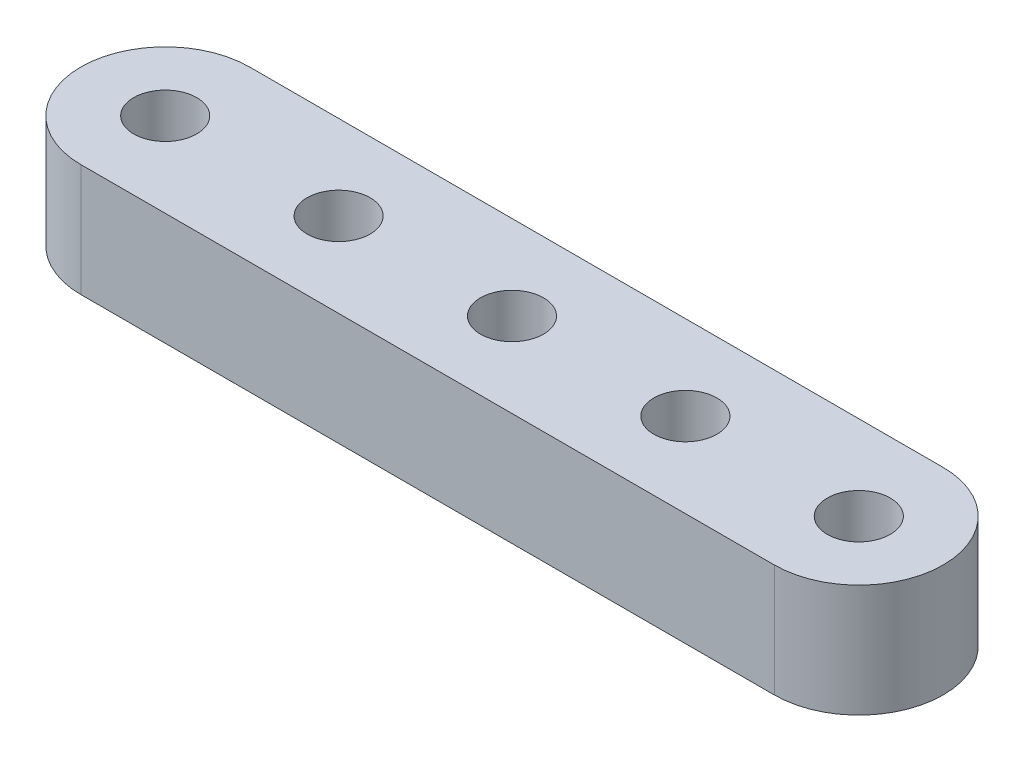
ISO-10303-21;
HEADER;
FILE_DESCRIPTION(('STEP AP214'),'2;1');
FILE_NAME('part.step','',(''),(''),'','','');
FILE_SCHEMA(('AUTOMOTIVE_DESIGN { 1 0 10303 214 1 1 1 1 }'));
ENDSEC;
DATA;
#1=APPLICATION_CONTEXT('core data for automotive mechanical design processes');
#2=APPLICATION_PROTOCOL_DEFINITION('international standard','automotive_design',2000,#1);
#3=PRODUCT_CONTEXT('',#1,'mechanical');
#4=PRODUCT('Part','Part','',(#3));
#5=PRODUCT_RELATED_PRODUCT_CATEGORY('part','',(#4));
#6=PRODUCT_DEFINITION_FORMATION('','',#4);
#7=PRODUCT_DEFINITION_CONTEXT('part definition',#1,'design');
#8=PRODUCT_DEFINITION('design','',#6,#7);
#9=PRODUCT_DEFINITION_SHAPE('','',#8);
#10=(LENGTH_UNIT() NAMED_UNIT(*) SI_UNIT(.MILLI.,.METRE.));
#11=(NAMED_UNIT(*) PLANE_ANGLE_UNIT() SI_UNIT($,.RADIAN.));
#12=(NAMED_UNIT(*) SI_UNIT($,.STERADIAN.) SOLID_ANGLE_UNIT());
#13=UNCERTAINTY_MEASURE_WITH_UNIT(LENGTH_MEASURE(1.E-05),#10,'distance_accuracy_value','');
#14=(GEOMETRIC_REPRESENTATION_CONTEXT(3) GLOBAL_UNCERTAINTY_ASSIGNED_CONTEXT((#13)) GLOBAL_UNIT_ASSIGNED_CONTEXT((#10,
#11,#12)) REPRESENTATION_CONTEXT('',''));
#15=CARTESIAN_POINT('',(0.,0.,0.));
#16=DIRECTION('',(0.,0.,1.));
#17=DIRECTION('',(1.,0.,0.));
#18=AXIS2_PLACEMENT_3D('',#15,#16,#17);
#19=CARTESIAN_POINT('',(19.558,0.,0.));
#20=DIRECTION('',(0.,1.,0.));
#21=DIRECTION('',(0.,0.,1.));
#22=AXIS2_PLACEMENT_3D('',#19,#20,#21);
#23=CYLINDRICAL_SURFACE('',#22,4.7625);
#24=CARTESIAN_POINT('',(19.558,6.35,0.));
#25=DIRECTION('',(0.,1.,0.));
#26=DIRECTION('',(0.,0.,1.));
#27=AXIS2_PLACEMENT_3D('',#24,#25,#26);
#28=CIRCLE('',#27,4.7625);
#29=CARTESIAN_POINT('',(19.558,6.35,4.76250000000001));
#30=VERTEX_POINT('',#29);
#31=CARTESIAN_POINT('',(19.558,6.35,-4.7625));
#32=VERTEX_POINT('',#31);
#33=EDGE_CURVE('E97',#30,#32,#28,.T.);
#34=ORIENTED_EDGE('',*,*,#33,.F.);
#35=DIRECTION('',(0.,1.,0.));
#36=VECTOR('',#35,1.);
#37=CARTESIAN_POINT('',(19.558,0.,4.76250000000001));
#38=LINE('',#37,#36);
#39=CARTESIAN_POINT('',(19.558,0.,4.76250000000001));
#40=VERTEX_POINT('',#39);
#41=EDGE_CURVE('E11',#40,#30,#38,.T.);
#42=ORIENTED_EDGE('',*,*,#41,.F.);
#43=CARTESIAN_POINT('',(19.558,0.,0.));
#44=DIRECTION('',(0.,1.,0.));
#45=DIRECTION('',(0.,0.,1.));
#46=AXIS2_PLACEMENT_3D('',#43,#44,#45);
#47=CIRCLE('',#46,4.7625);
#48=CARTESIAN_POINT('',(19.558,0.,-4.7625));
#49=VERTEX_POINT('',#48);
#50=EDGE_CURVE('E90',#40,#49,#47,.T.);
#51=ORIENTED_EDGE('',*,*,#50,.T.);
#52=DIRECTION('',(0.,1.,0.));
#53=VECTOR('',#52,1.);
#54=CARTESIAN_POINT('',(19.558,0.,-4.7625));
#55=LINE('',#54,#53);
#56=EDGE_CURVE('E35',#49,#32,#55,.T.);
#57=ORIENTED_EDGE('',*,*,#56,.T.);
#58=EDGE_LOOP('',(#34,#42,#51,#57));
#59=FACE_BOUND('',#58,.T.);
#60=ADVANCED_FACE('F32',(#59),#23,.T.);
#61=CARTESIAN_POINT('',(-19.558,0.,4.76250000000001));
#62=DIRECTION('',(0.,0.,1.));
#63=DIRECTION('',(1.,0.,0.));
#64=AXIS2_PLACEMENT_3D('',#61,#62,#63);
#65=PLANE('',#64);
#66=DIRECTION('',(1.,0.,0.));
#67=VECTOR('',#66,1.);
#68=CARTESIAN_POINT('',(-19.558,6.35,4.76250000000001));
#69=LINE('',#68,#67);
#70=CARTESIAN_POINT('',(-19.558,6.35,4.76250000000001));
#71=VERTEX_POINT('',#70);
#72=EDGE_CURVE('E92',#71,#30,#69,.T.);
#73=ORIENTED_EDGE('',*,*,#72,.F.);
#74=DIRECTION('',(0.,1.,0.));
#75=VECTOR('',#74,1.);
#76=CARTESIAN_POINT('',(-19.558,0.,4.76250000000001));
#77=LINE('',#76,#75);
#78=CARTESIAN_POINT('',(-19.558,0.,4.76250000000001));
#79=VERTEX_POINT('',#78);
#80=EDGE_CURVE('E41',#79,#71,#77,.T.);
#81=ORIENTED_EDGE('',*,*,#80,.F.);
#82=DIRECTION('',(1.,0.,0.));
#83=VECTOR('',#82,1.);
#84=CARTESIAN_POINT('',(-19.558,0.,4.76250000000001));
#85=LINE('',#84,#83);
#86=EDGE_CURVE('E87',#79,#40,#85,.T.);
#87=ORIENTED_EDGE('',*,*,#86,.T.);
#88=ORIENTED_EDGE('',*,*,#41,.T.);
#89=EDGE_LOOP('',(#73,#81,#87,#88));
#90=FACE_BOUND('',#89,.T.);
#91=ADVANCED_FACE('F108',(#90),#65,.T.);
#92=CARTESIAN_POINT('',(-19.558,0.,0.));
#93=DIRECTION('',(0.,1.,0.));
#94=DIRECTION('',(0.,0.,1.));
#95=AXIS2_PLACEMENT_3D('',#92,#93,#94);
#96=CYLINDRICAL_SURFACE('',#95,4.7625);
#97=CARTESIAN_POINT('',(-19.558,6.35,0.));
#98=DIRECTION('',(0.,1.,0.));
#99=DIRECTION('',(0.,0.,1.));
#100=AXIS2_PLACEMENT_3D('',#97,#98,#99);
#101=CIRCLE('',#100,4.7625);
#102=CARTESIAN_POINT('',(-19.558,6.35,-4.7625));
#103=VERTEX_POINT('',#102);
#104=EDGE_CURVE('E82',#103,#71,#101,.T.);
#105=ORIENTED_EDGE('',*,*,#104,.F.);
#106=DIRECTION('',(0.,1.,0.));
#107=VECTOR('',#106,1.);
#108=CARTESIAN_POINT('',(-19.558,0.,-4.7625));
#109=LINE('',#108,#107);
#110=CARTESIAN_POINT('',(-19.558,0.,-4.7625));
#111=VERTEX_POINT('',#110);
#112=EDGE_CURVE('E77',#111,#103,#109,.T.);
#113=ORIENTED_EDGE('',*,*,#112,.F.);
#114=CARTESIAN_POINT('',(-19.558,0.,0.));
#115=DIRECTION('',(0.,1.,0.));
#116=DIRECTION('',(0.,0.,1.));
#117=AXIS2_PLACEMENT_3D('',#114,#115,#116);
#118=CIRCLE('',#117,4.7625);
#119=EDGE_CURVE('E80',#111,#79,#118,.T.);
#120=ORIENTED_EDGE('',*,*,#119,.T.);
#121=ORIENTED_EDGE('',*,*,#80,.T.);
#122=EDGE_LOOP('',(#105,#113,#120,#121));
#123=FACE_BOUND('',#122,.T.);
#124=ADVANCED_FACE('F79',(#123),#96,.T.);
#125=CARTESIAN_POINT('',(19.558,0.,-4.7625));
#126=DIRECTION('',(0.,0.,-1.));
#127=DIRECTION('',(-1.,0.,0.));
#128=AXIS2_PLACEMENT_3D('',#125,#126,#127);
#129=PLANE('',#128);
#130=DIRECTION('',(-1.,0.,0.));
#131=VECTOR('',#130,1.);
#132=CARTESIAN_POINT('',(19.558,6.35,-4.7625));
#133=LINE('',#132,#131);
#134=EDGE_CURVE('E100',#32,#103,#133,.T.);
#135=ORIENTED_EDGE('',*,*,#134,.F.);
#136=ORIENTED_EDGE('',*,*,#56,.F.);
#137=DIRECTION('',(-1.,0.,0.));
#138=VECTOR('',#137,1.);
#139=CARTESIAN_POINT('',(19.558,0.,-4.7625));
#140=LINE('',#139,#138);
#141=EDGE_CURVE('E86',#49,#111,#140,.T.);
#142=ORIENTED_EDGE('',*,*,#141,.T.);
#143=ORIENTED_EDGE('',*,*,#112,.T.);
#144=EDGE_LOOP('',(#135,#136,#142,#143));
#145=FACE_BOUND('',#144,.T.);
#146=ADVANCED_FACE('F89',(#145),#129,.T.);
#147=CARTESIAN_POINT('',(19.558,0.,0.));
#148=DIRECTION('',(0.,1.,0.));
#149=DIRECTION('',(0.,0.,1.));
#150=AXIS2_PLACEMENT_3D('',#147,#148,#149);
#151=PLANE('',#150);
#152=CARTESIAN_POINT('',(-19.558,0.,0.));
#153=DIRECTION('',(0.,1.,0.));
#154=DIRECTION('',(0.,0.,-1.));
#155=AXIS2_PLACEMENT_3D('',#152,#153,#154);
#156=CIRCLE('',#155,1.77799999999998);
#157=CARTESIAN_POINT('',(-19.558,0.,-1.77799999999998));
#158=VERTEX_POINT('',#157);
#159=EDGE_CURVE('E153',#158,#158,#156,.T.);
#160=ORIENTED_EDGE('',*,*,#159,.T.);
#161=EDGE_LOOP('',(#160));
#162=FACE_BOUND('',#161,.T.);
#163=CARTESIAN_POINT('',(-9.779,0.,0.));
#164=DIRECTION('',(0.,1.,0.));
#165=DIRECTION('',(0.,0.,-1.));
#166=AXIS2_PLACEMENT_3D('',#163,#164,#165);
#167=CIRCLE('',#166,1.77799999999999);
#168=CARTESIAN_POINT('',(-9.779,0.,-1.77799999999999));
#169=VERTEX_POINT('',#168);
#170=EDGE_CURVE('E161',#169,#169,#167,.T.);
#171=ORIENTED_EDGE('',*,*,#170,.T.);
#172=EDGE_LOOP('',(#171));
#173=FACE_BOUND('',#172,.T.);
#174=CARTESIAN_POINT('',(0.,0.,0.));
#175=DIRECTION('',(0.,1.,0.));
#176=DIRECTION('',(0.,0.,-1.));
#177=AXIS2_PLACEMENT_3D('',#174,#175,#176);
#178=CIRCLE('',#177,1.77799999999999);
#179=CARTESIAN_POINT('',(0.,0.,-1.77799999999999));
#180=VERTEX_POINT('',#179);
#181=EDGE_CURVE('E167',#180,#180,#178,.T.);
#182=ORIENTED_EDGE('',*,*,#181,.T.);
#183=EDGE_LOOP('',(#182));
#184=FACE_BOUND('',#183,.T.);
#185=CARTESIAN_POINT('',(9.779,0.,0.));
#186=DIRECTION('',(0.,1.,0.));
#187=DIRECTION('',(0.,0.,-1.));
#188=AXIS2_PLACEMENT_3D('',#185,#186,#187);
#189=CIRCLE('',#188,1.77799999999999);
#190=CARTESIAN_POINT('',(9.779,0.,-1.77799999999998));
#191=VERTEX_POINT('',#190);
#192=EDGE_CURVE('E173',#191,#191,#189,.T.);
#193=ORIENTED_EDGE('',*,*,#192,.T.);
#194=EDGE_LOOP('',(#193));
#195=FACE_BOUND('',#194,.T.);
#196=CARTESIAN_POINT('',(19.558,0.,0.));
#197=DIRECTION('',(0.,1.,0.));
#198=DIRECTION('',(0.,0.,-1.));
#199=AXIS2_PLACEMENT_3D('',#196,#197,#198);
#200=CIRCLE('',#199,1.77799999999999);
#201=CARTESIAN_POINT('',(19.558,0.,-1.77799999999998));
#202=VERTEX_POINT('',#201);
#203=EDGE_CURVE('E101',#202,#202,#200,.T.);
#204=ORIENTED_EDGE('',*,*,#203,.T.);
#205=EDGE_LOOP('',(#204));
#206=FACE_BOUND('',#205,.T.);
#207=ORIENTED_EDGE('',*,*,#50,.F.);
#208=ORIENTED_EDGE('',*,*,#86,.F.);
#209=ORIENTED_EDGE('',*,*,#119,.F.);
#210=ORIENTED_EDGE('',*,*,#141,.F.);
#211=EDGE_LOOP('',(#207,#208,#209,#210));
#212=FACE_BOUND('',#211,.T.);
#213=ADVANCED_FACE('F85',(#162,#173,#184,#195,#206,#212),#151,.F.);
#214=CARTESIAN_POINT('',(19.558,6.35,0.));
#215=DIRECTION('',(0.,1.,0.));
#216=DIRECTION('',(0.,0.,1.));
#217=AXIS2_PLACEMENT_3D('',#214,#215,#216);
#218=PLANE('',#217);
#219=CARTESIAN_POINT('',(-19.558,6.35,0.));
#220=DIRECTION('',(0.,1.,0.));
#221=DIRECTION('',(0.,0.,-1.));
#222=AXIS2_PLACEMENT_3D('',#219,#220,#221);
#223=CIRCLE('',#222,1.77799999999998);
#224=CARTESIAN_POINT('',(-19.558,6.35,-1.77799999999998));
#225=VERTEX_POINT('',#224);
#226=EDGE_CURVE('E156',#225,#225,#223,.T.);
#227=ORIENTED_EDGE('',*,*,#226,.F.);
#228=EDGE_LOOP('',(#227));
#229=FACE_BOUND('',#228,.T.);
#230=CARTESIAN_POINT('',(-9.779,6.35,0.));
#231=DIRECTION('',(0.,1.,0.));
#232=DIRECTION('',(0.,0.,-1.));
#233=AXIS2_PLACEMENT_3D('',#230,#231,#232);
#234=CIRCLE('',#233,1.77799999999999);
#235=CARTESIAN_POINT('',(-9.779,6.35,-1.77799999999999));
#236=VERTEX_POINT('',#235);
#237=EDGE_CURVE('E158',#236,#236,#234,.T.);
#238=ORIENTED_EDGE('',*,*,#237,.F.);
#239=EDGE_LOOP('',(#238));
#240=FACE_BOUND('',#239,.T.);
#241=CARTESIAN_POINT('',(0.,6.35,0.));
#242=DIRECTION('',(0.,1.,0.));
#243=DIRECTION('',(0.,0.,-1.));
#244=AXIS2_PLACEMENT_3D('',#241,#242,#243);
#245=CIRCLE('',#244,1.77799999999999);
#246=CARTESIAN_POINT('',(0.,6.35,-1.77799999999999));
#247=VERTEX_POINT('',#246);
#248=EDGE_CURVE('E164',#247,#247,#245,.T.);
#249=ORIENTED_EDGE('',*,*,#248,.F.);
#250=EDGE_LOOP('',(#249));
#251=FACE_BOUND('',#250,.T.);
#252=CARTESIAN_POINT('',(9.779,6.35,0.));
#253=DIRECTION('',(0.,1.,0.));
#254=DIRECTION('',(0.,0.,-1.));
#255=AXIS2_PLACEMENT_3D('',#252,#253,#254);
#256=CIRCLE('',#255,1.77799999999999);
#257=CARTESIAN_POINT('',(9.779,6.35,-1.77799999999998));
#258=VERTEX_POINT('',#257);
#259=EDGE_CURVE('E170',#258,#258,#256,.T.);
#260=ORIENTED_EDGE('',*,*,#259,.F.);
#261=EDGE_LOOP('',(#260));
#262=FACE_BOUND('',#261,.T.);
#263=CARTESIAN_POINT('',(19.558,6.35,0.));
#264=DIRECTION('',(0.,1.,0.));
#265=DIRECTION('',(0.,0.,-1.));
#266=AXIS2_PLACEMENT_3D('',#263,#264,#265);
#267=CIRCLE('',#266,1.77799999999999);
#268=CARTESIAN_POINT('',(19.558,6.35,-1.77799999999998));
#269=VERTEX_POINT('',#268);
#270=EDGE_CURVE('E176',#269,#269,#267,.T.);
#271=ORIENTED_EDGE('',*,*,#270,.F.);
#272=EDGE_LOOP('',(#271));
#273=FACE_BOUND('',#272,.T.);
#274=ORIENTED_EDGE('',*,*,#33,.T.);
#275=ORIENTED_EDGE('',*,*,#134,.T.);
#276=ORIENTED_EDGE('',*,*,#104,.T.);
#277=ORIENTED_EDGE('',*,*,#72,.T.);
#278=EDGE_LOOP('',(#274,#275,#276,#277));
#279=FACE_BOUND('',#278,.T.);
#280=ADVANCED_FACE('F107',(#229,#240,#251,#262,#273,#279),#218,.T.);
#281=CARTESIAN_POINT('',(19.558,0.,0.));
#282=DIRECTION('',(0.,1.,0.));
#283=DIRECTION('',(0.,0.,1.));
#284=AXIS2_PLACEMENT_3D('',#281,#282,#283);
#285=CYLINDRICAL_SURFACE('',#284,1.77799999999999);
#286=ORIENTED_EDGE('',*,*,#203,.F.);
#287=EDGE_LOOP('',(#286));
#288=FACE_BOUND('',#287,.T.);
#289=ORIENTED_EDGE('',*,*,#270,.T.);
#290=EDGE_LOOP('',(#289));
#291=FACE_BOUND('',#290,.T.);
#292=ADVANCED_FACE('F126',(#288,#291),#285,.F.);
#293=CARTESIAN_POINT('',(9.779,0.,0.));
#294=DIRECTION('',(0.,1.,0.));
#295=DIRECTION('',(0.,0.,1.));
#296=AXIS2_PLACEMENT_3D('',#293,#294,#295);
#297=CYLINDRICAL_SURFACE('',#296,1.77799999999999);
#298=ORIENTED_EDGE('',*,*,#192,.F.);
#299=EDGE_LOOP('',(#298));
#300=FACE_BOUND('',#299,.T.);
#301=ORIENTED_EDGE('',*,*,#259,.T.);
#302=EDGE_LOOP('',(#301));
#303=FACE_BOUND('',#302,.T.);
#304=ADVANCED_FACE('F133',(#300,#303),#297,.F.);
#305=CARTESIAN_POINT('',(0.,0.,0.));
#306=DIRECTION('',(0.,1.,0.));
#307=DIRECTION('',(0.,0.,1.));
#308=AXIS2_PLACEMENT_3D('',#305,#306,#307);
#309=CYLINDRICAL_SURFACE('',#308,1.77799999999999);
#310=ORIENTED_EDGE('',*,*,#181,.F.);
#311=EDGE_LOOP('',(#310));
#312=FACE_BOUND('',#311,.T.);
#313=ORIENTED_EDGE('',*,*,#248,.T.);
#314=EDGE_LOOP('',(#313));
#315=FACE_BOUND('',#314,.T.);
#316=ADVANCED_FACE('F137',(#312,#315),#309,.F.);
#317=CARTESIAN_POINT('',(-9.779,0.,0.));
#318=DIRECTION('',(0.,1.,0.));
#319=DIRECTION('',(0.,0.,1.));
#320=AXIS2_PLACEMENT_3D('',#317,#318,#319);
#321=CYLINDRICAL_SURFACE('',#320,1.77799999999999);
#322=ORIENTED_EDGE('',*,*,#170,.F.);
#323=EDGE_LOOP('',(#322));
#324=FACE_BOUND('',#323,.T.);
#325=ORIENTED_EDGE('',*,*,#237,.T.);
#326=EDGE_LOOP('',(#325));
#327=FACE_BOUND('',#326,.T.);
#328=ADVANCED_FACE('F141',(#324,#327),#321,.F.);
#329=CARTESIAN_POINT('',(-19.558,0.,0.));
#330=DIRECTION('',(0.,1.,0.));
#331=DIRECTION('',(0.,0.,1.));
#332=AXIS2_PLACEMENT_3D('',#329,#330,#331);
#333=CYLINDRICAL_SURFACE('',#332,1.77799999999998);
#334=ORIENTED_EDGE('',*,*,#159,.F.);
#335=EDGE_LOOP('',(#334));
#336=FACE_BOUND('',#335,.T.);
#337=ORIENTED_EDGE('',*,*,#226,.T.);
#338=EDGE_LOOP('',(#337));
#339=FACE_BOUND('',#338,.T.);
#340=ADVANCED_FACE('F145',(#336,#339),#333,.F.);
#341=CLOSED_SHELL('',(#60,#91,#124,#146,#213,#280,#292,#304,#316,#328,#340));
#342=MANIFOLD_SOLID_BREP('B2',#341);
#343=ADVANCED_BREP_SHAPE_REPRESENTATION('',(#18,#342),#14);
#344=SHAPE_DEFINITION_REPRESENTATION(#9,#343);
ENDSEC;
END-ISO-10303-21;
